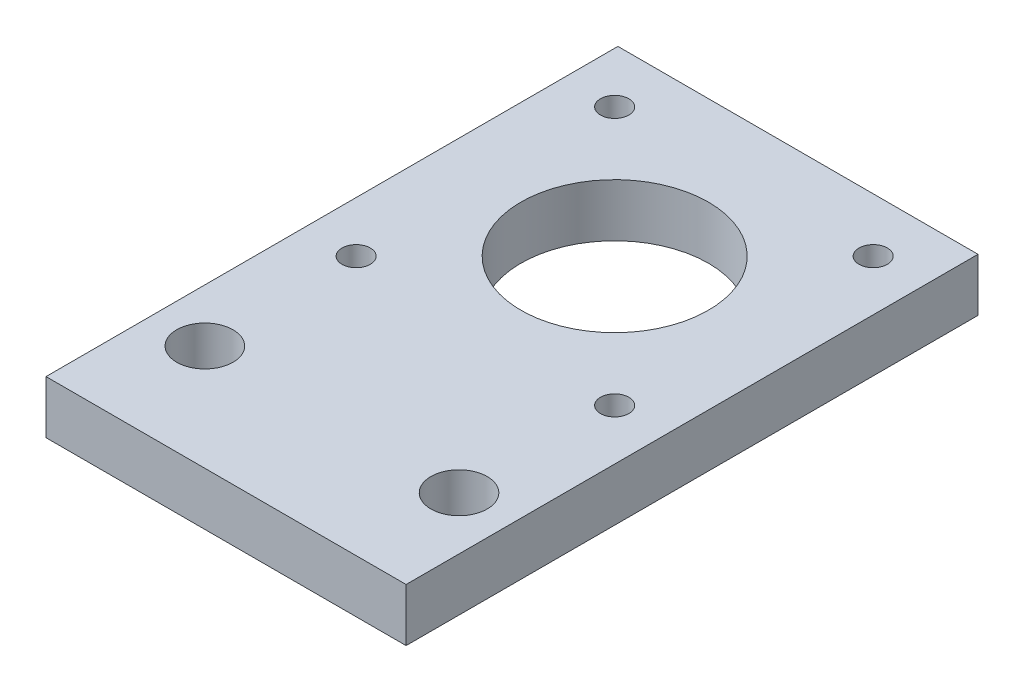
ISO-10303-21;
HEADER;
FILE_DESCRIPTION(('STEP AP214'),'2;1');
FILE_NAME('part.step','',(''),(''),'','','');
FILE_SCHEMA(('AUTOMOTIVE_DESIGN { 1 0 10303 214 1 1 1 1 }'));
ENDSEC;
DATA;
#1=APPLICATION_CONTEXT('core data for automotive mechanical design processes');
#2=APPLICATION_PROTOCOL_DEFINITION('international standard','automotive_design',2000,#1);
#3=PRODUCT_CONTEXT('',#1,'mechanical');
#4=PRODUCT('Part','Part','',(#3));
#5=PRODUCT_RELATED_PRODUCT_CATEGORY('part','',(#4));
#6=PRODUCT_DEFINITION_FORMATION('','',#4);
#7=PRODUCT_DEFINITION_CONTEXT('part definition',#1,'design');
#8=PRODUCT_DEFINITION('design','',#6,#7);
#9=PRODUCT_DEFINITION_SHAPE('','',#8);
#10=(LENGTH_UNIT() NAMED_UNIT(*) SI_UNIT(.MILLI.,.METRE.));
#11=(NAMED_UNIT(*) PLANE_ANGLE_UNIT() SI_UNIT($,.RADIAN.));
#12=(NAMED_UNIT(*) SI_UNIT($,.STERADIAN.) SOLID_ANGLE_UNIT());
#13=UNCERTAINTY_MEASURE_WITH_UNIT(LENGTH_MEASURE(1.E-05),#10,'distance_accuracy_value','');
#14=(GEOMETRIC_REPRESENTATION_CONTEXT(3) GLOBAL_UNCERTAINTY_ASSIGNED_CONTEXT((#13)) GLOBAL_UNIT_ASSIGNED_CONTEXT((#10,
#11,#12)) REPRESENTATION_CONTEXT('',''));
#15=CARTESIAN_POINT('',(0.,0.,0.));
#16=DIRECTION('',(0.,0.,1.));
#17=DIRECTION('',(1.,0.,0.));
#18=AXIS2_PLACEMENT_3D('',#15,#16,#17);
#19=CARTESIAN_POINT('',(-21.59,6.35,34.29));
#20=DIRECTION('',(1.,0.,0.));
#21=DIRECTION('',(0.,0.,-1.));
#22=AXIS2_PLACEMENT_3D('',#19,#20,#21);
#23=PLANE('',#22);
#24=DIRECTION('',(0.,0.,1.));
#25=VECTOR('',#24,1.);
#26=CARTESIAN_POINT('',(-21.59,0.,34.29));
#27=LINE('',#26,#25);
#28=CARTESIAN_POINT('',(-21.59,0.,-34.29));
#29=VERTEX_POINT('',#28);
#30=CARTESIAN_POINT('',(-21.59,0.,34.29));
#31=VERTEX_POINT('',#30);
#32=EDGE_CURVE('E95',#29,#31,#27,.T.);
#33=ORIENTED_EDGE('',*,*,#32,.T.);
#34=DIRECTION('',(0.,-1.,0.));
#35=VECTOR('',#34,1.);
#36=CARTESIAN_POINT('',(-21.59,6.35,34.29));
#37=LINE('',#36,#35);
#38=CARTESIAN_POINT('',(-21.59,6.35,34.29));
#39=VERTEX_POINT('',#38);
#40=EDGE_CURVE('E11',#39,#31,#37,.T.);
#41=ORIENTED_EDGE('',*,*,#40,.F.);
#42=DIRECTION('',(0.,0.,1.));
#43=VECTOR('',#42,1.);
#44=CARTESIAN_POINT('',(-21.59,6.35,34.29));
#45=LINE('',#44,#43);
#46=CARTESIAN_POINT('',(-21.59,6.35,-34.29));
#47=VERTEX_POINT('',#46);
#48=EDGE_CURVE('E83',#47,#39,#45,.T.);
#49=ORIENTED_EDGE('',*,*,#48,.F.);
#50=DIRECTION('',(0.,-1.,0.));
#51=VECTOR('',#50,1.);
#52=CARTESIAN_POINT('',(-21.59,6.35,-34.29));
#53=LINE('',#52,#51);
#54=EDGE_CURVE('E91',#47,#29,#53,.T.);
#55=ORIENTED_EDGE('',*,*,#54,.T.);
#56=EDGE_LOOP('',(#33,#41,#49,#55));
#57=FACE_BOUND('',#56,.T.);
#58=ADVANCED_FACE('F32',(#57),#23,.F.);
#59=CARTESIAN_POINT('',(21.59,6.35,34.29));
#60=DIRECTION('',(0.,0.,-1.));
#61=DIRECTION('',(-1.,0.,0.));
#62=AXIS2_PLACEMENT_3D('',#59,#60,#61);
#63=PLANE('',#62);
#64=DIRECTION('',(1.,0.,0.));
#65=VECTOR('',#64,1.);
#66=CARTESIAN_POINT('',(21.59,0.,34.29));
#67=LINE('',#66,#65);
#68=CARTESIAN_POINT('',(21.59,0.,34.29));
#69=VERTEX_POINT('',#68);
#70=EDGE_CURVE('E87',#31,#69,#67,.T.);
#71=ORIENTED_EDGE('',*,*,#70,.T.);
#72=DIRECTION('',(0.,-1.,0.));
#73=VECTOR('',#72,1.);
#74=CARTESIAN_POINT('',(21.59,6.35,34.29));
#75=LINE('',#74,#73);
#76=CARTESIAN_POINT('',(21.59,6.35,34.29));
#77=VERTEX_POINT('',#76);
#78=EDGE_CURVE('E40',#77,#69,#75,.T.);
#79=ORIENTED_EDGE('',*,*,#78,.F.);
#80=DIRECTION('',(1.,0.,0.));
#81=VECTOR('',#80,1.);
#82=CARTESIAN_POINT('',(21.59,6.35,34.29));
#83=LINE('',#82,#81);
#84=EDGE_CURVE('E78',#39,#77,#83,.T.);
#85=ORIENTED_EDGE('',*,*,#84,.F.);
#86=ORIENTED_EDGE('',*,*,#40,.T.);
#87=EDGE_LOOP('',(#71,#79,#85,#86));
#88=FACE_BOUND('',#87,.T.);
#89=ADVANCED_FACE('F86',(#88),#63,.F.);
#90=CARTESIAN_POINT('',(21.59,6.35,34.29));
#91=DIRECTION('',(-1.,0.,0.));
#92=DIRECTION('',(0.,0.,1.));
#93=AXIS2_PLACEMENT_3D('',#90,#91,#92);
#94=PLANE('',#93);
#95=DIRECTION('',(0.,0.,-1.));
#96=VECTOR('',#95,1.);
#97=CARTESIAN_POINT('',(21.59,0.,34.29));
#98=LINE('',#97,#96);
#99=CARTESIAN_POINT('',(21.59,0.,-34.29));
#100=VERTEX_POINT('',#99);
#101=EDGE_CURVE('E65',#69,#100,#98,.T.);
#102=ORIENTED_EDGE('',*,*,#101,.T.);
#103=DIRECTION('',(0.,-1.,0.));
#104=VECTOR('',#103,1.);
#105=CARTESIAN_POINT('',(21.59,6.35,-34.29));
#106=LINE('',#105,#104);
#107=CARTESIAN_POINT('',(21.59,6.35,-34.29));
#108=VERTEX_POINT('',#107);
#109=EDGE_CURVE('E88',#108,#100,#106,.T.);
#110=ORIENTED_EDGE('',*,*,#109,.F.);
#111=DIRECTION('',(0.,0.,-1.));
#112=VECTOR('',#111,1.);
#113=CARTESIAN_POINT('',(21.59,6.35,34.29));
#114=LINE('',#113,#112);
#115=EDGE_CURVE('E81',#77,#108,#114,.T.);
#116=ORIENTED_EDGE('',*,*,#115,.F.);
#117=ORIENTED_EDGE('',*,*,#78,.T.);
#118=EDGE_LOOP('',(#102,#110,#116,#117));
#119=FACE_BOUND('',#118,.T.);
#120=ADVANCED_FACE('F89',(#119),#94,.F.);
#121=CARTESIAN_POINT('',(21.59,6.35,-34.29));
#122=DIRECTION('',(0.,0.,1.));
#123=DIRECTION('',(1.,0.,0.));
#124=AXIS2_PLACEMENT_3D('',#121,#122,#123);
#125=PLANE('',#124);
#126=DIRECTION('',(-1.,0.,0.));
#127=VECTOR('',#126,1.);
#128=CARTESIAN_POINT('',(21.59,0.,-34.29));
#129=LINE('',#128,#127);
#130=EDGE_CURVE('E71',#100,#29,#129,.T.);
#131=ORIENTED_EDGE('',*,*,#130,.T.);
#132=ORIENTED_EDGE('',*,*,#54,.F.);
#133=DIRECTION('',(-1.,0.,0.));
#134=VECTOR('',#133,1.);
#135=CARTESIAN_POINT('',(21.59,6.35,-34.29));
#136=LINE('',#135,#134);
#137=EDGE_CURVE('E48',#108,#47,#136,.T.);
#138=ORIENTED_EDGE('',*,*,#137,.F.);
#139=ORIENTED_EDGE('',*,*,#109,.T.);
#140=EDGE_LOOP('',(#131,#132,#138,#139));
#141=FACE_BOUND('',#140,.T.);
#142=ADVANCED_FACE('F103',(#141),#125,.F.);
#143=CARTESIAN_POINT('',(0.,6.35,0.));
#144=DIRECTION('',(0.,1.,0.));
#145=DIRECTION('',(0.,0.,1.));
#146=AXIS2_PLACEMENT_3D('',#143,#144,#145);
#147=PLANE('',#146);
#148=CARTESIAN_POINT('',(15.5,6.35,-27.81));
#149=DIRECTION('',(0.,-1.,0.));
#150=DIRECTION('',(0.,0.,-1.));
#151=AXIS2_PLACEMENT_3D('',#148,#149,#150);
#152=CIRCLE('',#151,1.7);
#153=CARTESIAN_POINT('',(15.5,6.35,-29.51));
#154=VERTEX_POINT('',#153);
#155=EDGE_CURVE('E144',#154,#154,#152,.T.);
#156=ORIENTED_EDGE('',*,*,#155,.T.);
#157=EDGE_LOOP('',(#156));
#158=FACE_BOUND('',#157,.T.);
#159=CARTESIAN_POINT('',(-15.5,6.35,-27.81));
#160=DIRECTION('',(0.,-1.,0.));
#161=DIRECTION('',(0.,0.,-1.));
#162=AXIS2_PLACEMENT_3D('',#159,#160,#161);
#163=CIRCLE('',#162,1.7);
#164=CARTESIAN_POINT('',(-15.5,6.35,-29.51));
#165=VERTEX_POINT('',#164);
#166=EDGE_CURVE('E138',#165,#165,#163,.T.);
#167=ORIENTED_EDGE('',*,*,#166,.T.);
#168=EDGE_LOOP('',(#167));
#169=FACE_BOUND('',#168,.T.);
#170=CARTESIAN_POINT('',(-15.5,6.35,3.19000000000002));
#171=DIRECTION('',(0.,-1.,0.));
#172=DIRECTION('',(0.,0.,-1.));
#173=AXIS2_PLACEMENT_3D('',#170,#171,#172);
#174=CIRCLE('',#173,1.7);
#175=CARTESIAN_POINT('',(-15.5,6.35,1.49000000000002));
#176=VERTEX_POINT('',#175);
#177=EDGE_CURVE('E132',#176,#176,#174,.T.);
#178=ORIENTED_EDGE('',*,*,#177,.T.);
#179=EDGE_LOOP('',(#178));
#180=FACE_BOUND('',#179,.T.);
#181=CARTESIAN_POINT('',(15.5,6.35,3.19000000000001));
#182=DIRECTION('',(0.,-1.,0.));
#183=DIRECTION('',(0.,0.,-1.));
#184=AXIS2_PLACEMENT_3D('',#181,#182,#183);
#185=CIRCLE('',#184,1.7);
#186=CARTESIAN_POINT('',(15.5,6.35,1.49000000000002));
#187=VERTEX_POINT('',#186);
#188=EDGE_CURVE('E124',#187,#187,#185,.T.);
#189=ORIENTED_EDGE('',*,*,#188,.T.);
#190=EDGE_LOOP('',(#189));
#191=FACE_BOUND('',#190,.T.);
#192=CARTESIAN_POINT('',(0.,6.35,-12.31));
#193=DIRECTION('',(0.,-1.,0.));
#194=DIRECTION('',(0.,0.,-1.));
#195=AXIS2_PLACEMENT_3D('',#192,#193,#194);
#196=CIRCLE('',#195,11.239);
#197=CARTESIAN_POINT('',(0.,6.35,-23.549));
#198=VERTEX_POINT('',#197);
#199=EDGE_CURVE('E120',#198,#198,#196,.T.);
#200=ORIENTED_EDGE('',*,*,#199,.T.);
#201=EDGE_LOOP('',(#200));
#202=FACE_BOUND('',#201,.T.);
#203=CARTESIAN_POINT('',(-15.24,6.35,21.59));
#204=DIRECTION('',(0.,1.,0.));
#205=DIRECTION('',(0.,0.,1.));
#206=AXIS2_PLACEMENT_3D('',#203,#204,#205);
#207=CIRCLE('',#206,3.37819999999999);
#208=CARTESIAN_POINT('',(-15.24,6.35,24.9682));
#209=VERTEX_POINT('',#208);
#210=EDGE_CURVE('E117',#209,#209,#207,.T.);
#211=ORIENTED_EDGE('',*,*,#210,.F.);
#212=EDGE_LOOP('',(#211));
#213=FACE_BOUND('',#212,.T.);
#214=CARTESIAN_POINT('',(15.24,6.35,21.59));
#215=DIRECTION('',(0.,1.,0.));
#216=DIRECTION('',(0.,0.,1.));
#217=AXIS2_PLACEMENT_3D('',#214,#215,#216);
#218=CIRCLE('',#217,3.37819999999999);
#219=CARTESIAN_POINT('',(15.24,6.35,24.9682));
#220=VERTEX_POINT('',#219);
#221=EDGE_CURVE('E111',#220,#220,#218,.T.);
#222=ORIENTED_EDGE('',*,*,#221,.F.);
#223=EDGE_LOOP('',(#222));
#224=FACE_BOUND('',#223,.T.);
#225=ORIENTED_EDGE('',*,*,#48,.T.);
#226=ORIENTED_EDGE('',*,*,#84,.T.);
#227=ORIENTED_EDGE('',*,*,#115,.T.);
#228=ORIENTED_EDGE('',*,*,#137,.T.);
#229=EDGE_LOOP('',(#225,#226,#227,#228));
#230=FACE_BOUND('',#229,.T.);
#231=ADVANCED_FACE('F79',(#158,#169,#180,#191,#202,#213,#224,#230),#147,.T.);
#232=CARTESIAN_POINT('',(0.,0.,0.));
#233=DIRECTION('',(0.,1.,0.));
#234=DIRECTION('',(0.,0.,1.));
#235=AXIS2_PLACEMENT_3D('',#232,#233,#234);
#236=PLANE('',#235);
#237=CARTESIAN_POINT('',(15.5,0.,-27.81));
#238=DIRECTION('',(0.,-1.,0.));
#239=DIRECTION('',(0.,0.,-1.));
#240=AXIS2_PLACEMENT_3D('',#237,#238,#239);
#241=CIRCLE('',#240,1.7);
#242=CARTESIAN_POINT('',(15.5,0.,-29.51));
#243=VERTEX_POINT('',#242);
#244=EDGE_CURVE('E147',#243,#243,#241,.T.);
#245=ORIENTED_EDGE('',*,*,#244,.F.);
#246=EDGE_LOOP('',(#245));
#247=FACE_BOUND('',#246,.T.);
#248=CARTESIAN_POINT('',(-15.5,0.,-27.81));
#249=DIRECTION('',(0.,-1.,0.));
#250=DIRECTION('',(0.,0.,-1.));
#251=AXIS2_PLACEMENT_3D('',#248,#249,#250);
#252=CIRCLE('',#251,1.7);
#253=CARTESIAN_POINT('',(-15.5,0.,-29.51));
#254=VERTEX_POINT('',#253);
#255=EDGE_CURVE('E141',#254,#254,#252,.T.);
#256=ORIENTED_EDGE('',*,*,#255,.F.);
#257=EDGE_LOOP('',(#256));
#258=FACE_BOUND('',#257,.T.);
#259=CARTESIAN_POINT('',(-15.5,0.,3.19000000000002));
#260=DIRECTION('',(0.,-1.,0.));
#261=DIRECTION('',(0.,0.,-1.));
#262=AXIS2_PLACEMENT_3D('',#259,#260,#261);
#263=CIRCLE('',#262,1.7);
#264=CARTESIAN_POINT('',(-15.5,0.,1.49000000000002));
#265=VERTEX_POINT('',#264);
#266=EDGE_CURVE('E135',#265,#265,#263,.T.);
#267=ORIENTED_EDGE('',*,*,#266,.F.);
#268=EDGE_LOOP('',(#267));
#269=FACE_BOUND('',#268,.T.);
#270=CARTESIAN_POINT('',(15.5,0.,3.19000000000001));
#271=DIRECTION('',(0.,-1.,0.));
#272=DIRECTION('',(0.,0.,-1.));
#273=AXIS2_PLACEMENT_3D('',#270,#271,#272);
#274=CIRCLE('',#273,1.7);
#275=CARTESIAN_POINT('',(15.5,0.,1.49000000000001));
#276=VERTEX_POINT('',#275);
#277=EDGE_CURVE('E129',#276,#276,#274,.T.);
#278=ORIENTED_EDGE('',*,*,#277,.F.);
#279=EDGE_LOOP('',(#278));
#280=FACE_BOUND('',#279,.T.);
#281=CARTESIAN_POINT('',(0.,0.,-12.31));
#282=DIRECTION('',(0.,-1.,0.));
#283=DIRECTION('',(0.,0.,-1.));
#284=AXIS2_PLACEMENT_3D('',#281,#282,#283);
#285=CIRCLE('',#284,11.239);
#286=CARTESIAN_POINT('',(0.,0.,-23.549));
#287=VERTEX_POINT('',#286);
#288=EDGE_CURVE('E121',#287,#287,#285,.T.);
#289=ORIENTED_EDGE('',*,*,#288,.F.);
#290=EDGE_LOOP('',(#289));
#291=FACE_BOUND('',#290,.T.);
#292=CARTESIAN_POINT('',(-15.24,0.,21.59));
#293=DIRECTION('',(0.,1.,0.));
#294=DIRECTION('',(0.,0.,1.));
#295=AXIS2_PLACEMENT_3D('',#292,#293,#294);
#296=CIRCLE('',#295,3.3782);
#297=CARTESIAN_POINT('',(-15.24,0.,24.9682));
#298=VERTEX_POINT('',#297);
#299=EDGE_CURVE('E114',#298,#298,#296,.T.);
#300=ORIENTED_EDGE('',*,*,#299,.T.);
#301=EDGE_LOOP('',(#300));
#302=FACE_BOUND('',#301,.T.);
#303=CARTESIAN_POINT('',(15.24,0.,21.59));
#304=DIRECTION('',(0.,1.,0.));
#305=DIRECTION('',(0.,0.,1.));
#306=AXIS2_PLACEMENT_3D('',#303,#304,#305);
#307=CIRCLE('',#306,3.3782);
#308=CARTESIAN_POINT('',(15.24,0.,24.9682));
#309=VERTEX_POINT('',#308);
#310=EDGE_CURVE('E98',#309,#309,#307,.T.);
#311=ORIENTED_EDGE('',*,*,#310,.T.);
#312=EDGE_LOOP('',(#311));
#313=FACE_BOUND('',#312,.T.);
#314=ORIENTED_EDGE('',*,*,#32,.F.);
#315=ORIENTED_EDGE('',*,*,#130,.F.);
#316=ORIENTED_EDGE('',*,*,#101,.F.);
#317=ORIENTED_EDGE('',*,*,#70,.F.);
#318=EDGE_LOOP('',(#314,#315,#316,#317));
#319=FACE_BOUND('',#318,.T.);
#320=ADVANCED_FACE('F106',(#247,#258,#269,#280,#291,#302,#313,#319),#236,.F.);
#321=CARTESIAN_POINT('',(15.24,6.35,21.59));
#322=DIRECTION('',(0.,1.,0.));
#323=DIRECTION('',(0.,0.,1.));
#324=AXIS2_PLACEMENT_3D('',#321,#322,#323);
#325=CYLINDRICAL_SURFACE('',#324,3.37819999999999);
#326=ORIENTED_EDGE('',*,*,#310,.F.);
#327=EDGE_LOOP('',(#326));
#328=FACE_BOUND('',#327,.T.);
#329=ORIENTED_EDGE('',*,*,#221,.T.);
#330=EDGE_LOOP('',(#329));
#331=FACE_BOUND('',#330,.T.);
#332=ADVANCED_FACE('F155',(#328,#331),#325,.F.);
#333=CARTESIAN_POINT('',(-15.24,6.35,21.59));
#334=DIRECTION('',(0.,1.,0.));
#335=DIRECTION('',(0.,0.,1.));
#336=AXIS2_PLACEMENT_3D('',#333,#334,#335);
#337=CYLINDRICAL_SURFACE('',#336,3.37819999999999);
#338=ORIENTED_EDGE('',*,*,#299,.F.);
#339=EDGE_LOOP('',(#338));
#340=FACE_BOUND('',#339,.T.);
#341=ORIENTED_EDGE('',*,*,#210,.T.);
#342=EDGE_LOOP('',(#341));
#343=FACE_BOUND('',#342,.T.);
#344=ADVANCED_FACE('F171',(#340,#343),#337,.F.);
#345=CARTESIAN_POINT('',(0.,6.35,-12.31));
#346=DIRECTION('',(0.,-1.,0.));
#347=DIRECTION('',(0.,0.,-1.));
#348=AXIS2_PLACEMENT_3D('',#345,#346,#347);
#349=CYLINDRICAL_SURFACE('',#348,11.239);
#350=ORIENTED_EDGE('',*,*,#199,.F.);
#351=EDGE_LOOP('',(#350));
#352=FACE_BOUND('',#351,.T.);
#353=ORIENTED_EDGE('',*,*,#288,.T.);
#354=EDGE_LOOP('',(#353));
#355=FACE_BOUND('',#354,.T.);
#356=ADVANCED_FACE('F219',(#352,#355),#349,.F.);
#357=CARTESIAN_POINT('',(15.5,0.,3.19000000000001));
#358=DIRECTION('',(0.,-1.,0.));
#359=DIRECTION('',(0.,0.,-1.));
#360=AXIS2_PLACEMENT_3D('',#357,#358,#359);
#361=CYLINDRICAL_SURFACE('',#360,1.7);
#362=ORIENTED_EDGE('',*,*,#188,.F.);
#363=EDGE_LOOP('',(#362));
#364=FACE_BOUND('',#363,.T.);
#365=ORIENTED_EDGE('',*,*,#277,.T.);
#366=EDGE_LOOP('',(#365));
#367=FACE_BOUND('',#366,.T.);
#368=ADVANCED_FACE('F226',(#364,#367),#361,.F.);
#369=CARTESIAN_POINT('',(-15.5,0.,3.19000000000002));
#370=DIRECTION('',(0.,-1.,0.));
#371=DIRECTION('',(0.,0.,-1.));
#372=AXIS2_PLACEMENT_3D('',#369,#370,#371);
#373=CYLINDRICAL_SURFACE('',#372,1.7);
#374=ORIENTED_EDGE('',*,*,#177,.F.);
#375=EDGE_LOOP('',(#374));
#376=FACE_BOUND('',#375,.T.);
#377=ORIENTED_EDGE('',*,*,#266,.T.);
#378=EDGE_LOOP('',(#377));
#379=FACE_BOUND('',#378,.T.);
#380=ADVANCED_FACE('F233',(#376,#379),#373,.F.);
#381=CARTESIAN_POINT('',(-15.5,0.,-27.81));
#382=DIRECTION('',(0.,-1.,0.));
#383=DIRECTION('',(0.,0.,-1.));
#384=AXIS2_PLACEMENT_3D('',#381,#382,#383);
#385=CYLINDRICAL_SURFACE('',#384,1.7);
#386=ORIENTED_EDGE('',*,*,#166,.F.);
#387=EDGE_LOOP('',(#386));
#388=FACE_BOUND('',#387,.T.);
#389=ORIENTED_EDGE('',*,*,#255,.T.);
#390=EDGE_LOOP('',(#389));
#391=FACE_BOUND('',#390,.T.);
#392=ADVANCED_FACE('F241',(#388,#391),#385,.F.);
#393=CARTESIAN_POINT('',(15.5,0.,-27.81));
#394=DIRECTION('',(0.,-1.,0.));
#395=DIRECTION('',(0.,0.,-1.));
#396=AXIS2_PLACEMENT_3D('',#393,#394,#395);
#397=CYLINDRICAL_SURFACE('',#396,1.7);
#398=ORIENTED_EDGE('',*,*,#155,.F.);
#399=EDGE_LOOP('',(#398));
#400=FACE_BOUND('',#399,.T.);
#401=ORIENTED_EDGE('',*,*,#244,.T.);
#402=EDGE_LOOP('',(#401));
#403=FACE_BOUND('',#402,.T.);
#404=ADVANCED_FACE('F151',(#400,#403),#397,.F.);
#405=CLOSED_SHELL('',(#58,#89,#120,#142,#231,#320,#332,#344,#356,#368,#380,#392,#404));
#406=MANIFOLD_SOLID_BREP('B2',#405);
#407=ADVANCED_BREP_SHAPE_REPRESENTATION('',(#18,#406),#14);
#408=SHAPE_DEFINITION_REPRESENTATION(#9,#407);
ENDSEC;
END-ISO-10303-21;
